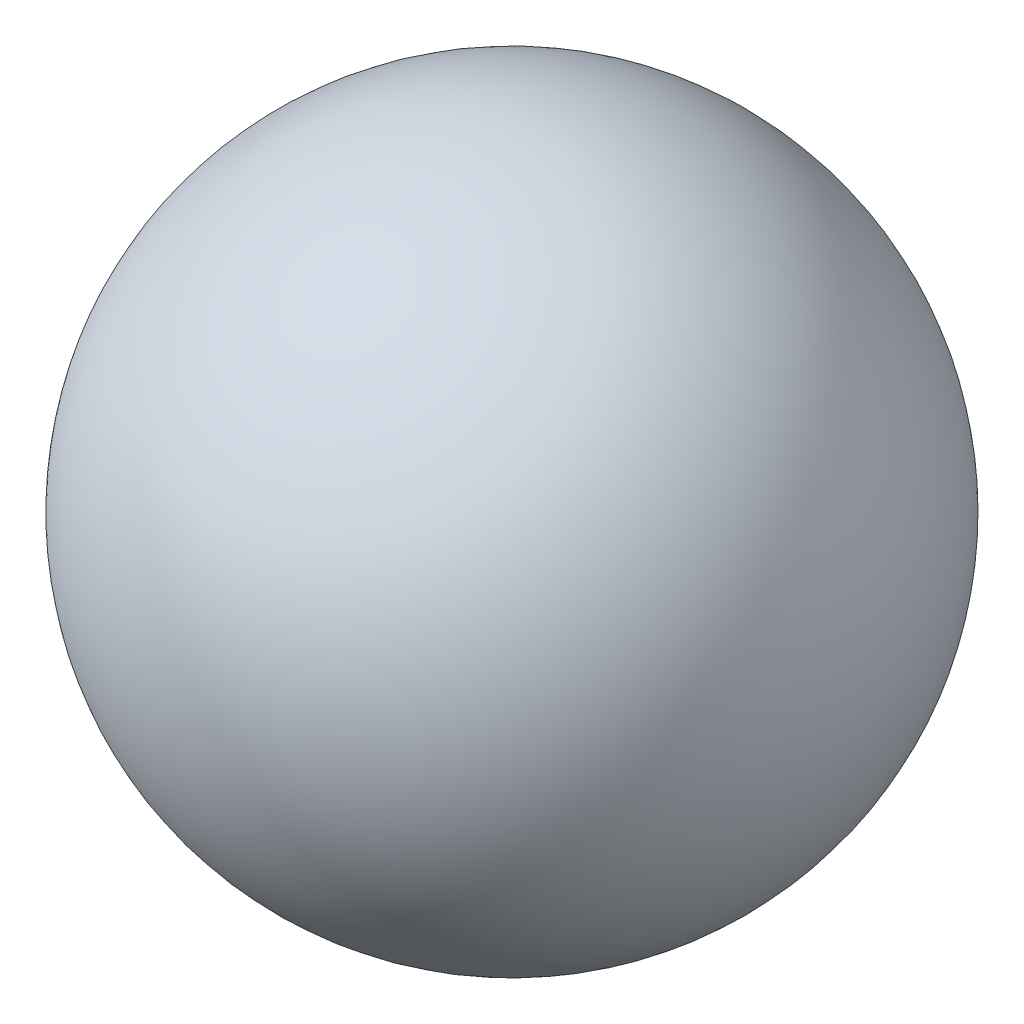
ISO-10303-21;
HEADER;
FILE_DESCRIPTION(('STEP AP214'),'2;1');
FILE_NAME('part.step','',(''),(''),'','','');
FILE_SCHEMA(('AUTOMOTIVE_DESIGN { 1 0 10303 214 1 1 1 1 }'));
ENDSEC;
DATA;
#1=APPLICATION_CONTEXT('core data for automotive mechanical design processes');
#2=APPLICATION_PROTOCOL_DEFINITION('international standard','automotive_design',2000,#1);
#3=PRODUCT_CONTEXT('',#1,'mechanical');
#4=PRODUCT('Part','Part','',(#3));
#5=PRODUCT_RELATED_PRODUCT_CATEGORY('part','',(#4));
#6=PRODUCT_DEFINITION_FORMATION('','',#4);
#7=PRODUCT_DEFINITION_CONTEXT('part definition',#1,'design');
#8=PRODUCT_DEFINITION('design','',#6,#7);
#9=PRODUCT_DEFINITION_SHAPE('','',#8);
#10=(LENGTH_UNIT() NAMED_UNIT(*) SI_UNIT(.MILLI.,.METRE.));
#11=(NAMED_UNIT(*) PLANE_ANGLE_UNIT() SI_UNIT($,.RADIAN.));
#12=(NAMED_UNIT(*) SI_UNIT($,.STERADIAN.) SOLID_ANGLE_UNIT());
#13=UNCERTAINTY_MEASURE_WITH_UNIT(LENGTH_MEASURE(1.E-05),#10,'distance_accuracy_value','');
#14=(GEOMETRIC_REPRESENTATION_CONTEXT(3) GLOBAL_UNCERTAINTY_ASSIGNED_CONTEXT((#13)) GLOBAL_UNIT_ASSIGNED_CONTEXT((#10,
#11,#12)) REPRESENTATION_CONTEXT('',''));
#15=CARTESIAN_POINT('',(0.,0.,0.));
#16=DIRECTION('',(0.,0.,1.));
#17=DIRECTION('',(1.,0.,0.));
#18=AXIS2_PLACEMENT_3D('',#15,#16,#17);
#19=CARTESIAN_POINT('',(0.,88.9367701250468,29.7886672136982));
#20=DIRECTION('',(0.,0.556284044797591,0.830992215068007));
#21=DIRECTION('',(0.,0.830992215068007,-0.556284044797591));
#22=AXIS2_PLACEMENT_3D('',#19,#20,#21);
#23=SPHERICAL_SURFACE('',#22,37.5);
#24=CARTESIAN_POINT('',(0.,109.797421804956,60.9508752787484));
#25=VERTEX_POINT('',#24);
#26=VERTEX_LOOP('',#25);
#27=FACE_BOUND('',#26,.T.);
#28=ADVANCED_FACE('F33',(#27),#23,.T.);
#29=CLOSED_SHELL('',(#28));
#30=MANIFOLD_SOLID_BREP('B2',#29);
#31=ADVANCED_BREP_SHAPE_REPRESENTATION('',(#18,#30),#14);
#32=SHAPE_DEFINITION_REPRESENTATION(#9,#31);
ENDSEC;
END-ISO-10303-21;
